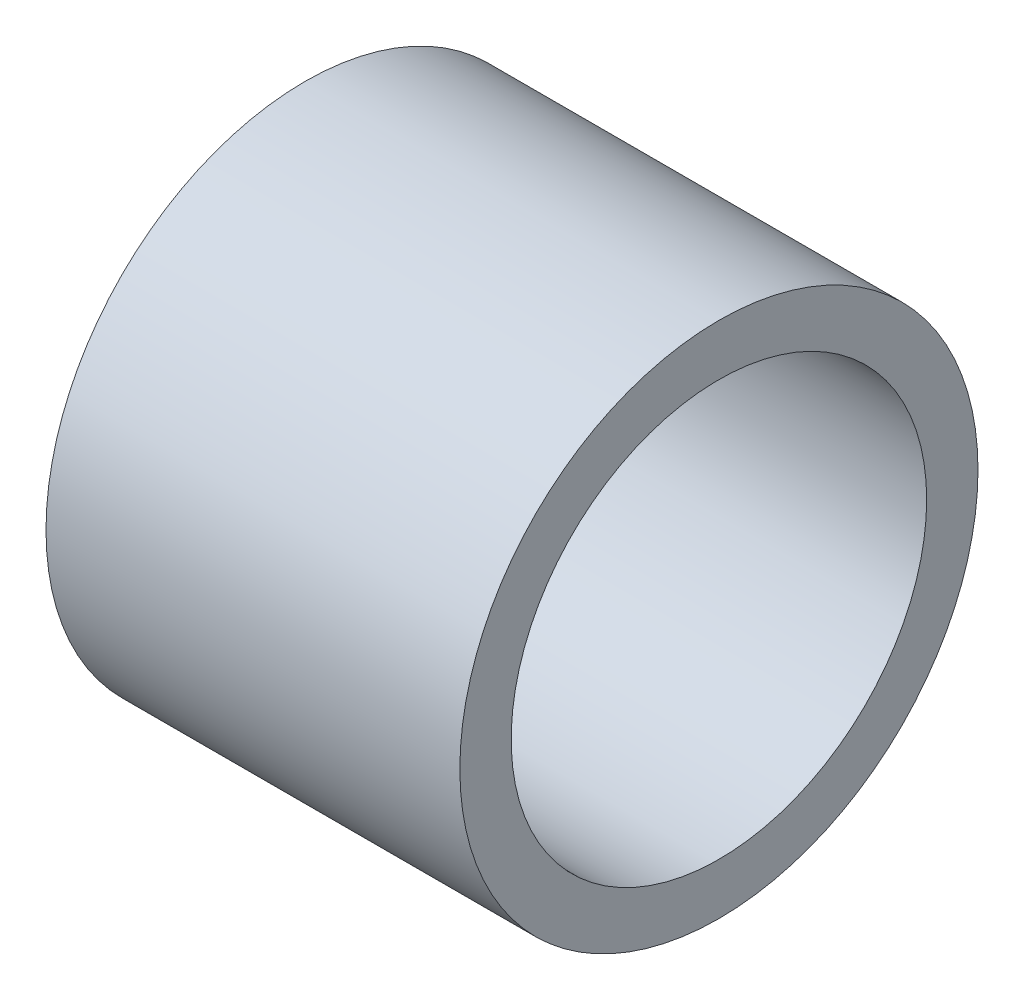
ISO-10303-21;
HEADER;
FILE_DESCRIPTION(('STEP AP214'),'2;1');
FILE_NAME('part.step','',(''),(''),'','','');
FILE_SCHEMA(('AUTOMOTIVE_DESIGN { 1 0 10303 214 1 1 1 1 }'));
ENDSEC;
DATA;
#1=APPLICATION_CONTEXT('core data for automotive mechanical design processes');
#2=APPLICATION_PROTOCOL_DEFINITION('international standard','automotive_design',2000,#1);
#3=PRODUCT_CONTEXT('',#1,'mechanical');
#4=PRODUCT('Part','Part','',(#3));
#5=PRODUCT_RELATED_PRODUCT_CATEGORY('part','',(#4));
#6=PRODUCT_DEFINITION_FORMATION('','',#4);
#7=PRODUCT_DEFINITION_CONTEXT('part definition',#1,'design');
#8=PRODUCT_DEFINITION('design','',#6,#7);
#9=PRODUCT_DEFINITION_SHAPE('','',#8);
#10=(LENGTH_UNIT() NAMED_UNIT(*) SI_UNIT(.MILLI.,.METRE.));
#11=(NAMED_UNIT(*) PLANE_ANGLE_UNIT() SI_UNIT($,.RADIAN.));
#12=(NAMED_UNIT(*) SI_UNIT($,.STERADIAN.) SOLID_ANGLE_UNIT());
#13=UNCERTAINTY_MEASURE_WITH_UNIT(LENGTH_MEASURE(1.E-05),#10,'distance_accuracy_value','');
#14=(GEOMETRIC_REPRESENTATION_CONTEXT(3) GLOBAL_UNCERTAINTY_ASSIGNED_CONTEXT((#13)) GLOBAL_UNIT_ASSIGNED_CONTEXT((#10,
#11,#12)) REPRESENTATION_CONTEXT('',''));
#15=CARTESIAN_POINT('',(0.,0.,0.));
#16=DIRECTION('',(0.,0.,1.));
#17=DIRECTION('',(1.,0.,0.));
#18=AXIS2_PLACEMENT_3D('',#15,#16,#17);
#19=CARTESIAN_POINT('',(3.175,0.,0.));
#20=DIRECTION('',(1.,0.,0.));
#21=DIRECTION('',(0.,0.,-1.));
#22=AXIS2_PLACEMENT_3D('',#19,#20,#21);
#23=PLANE('',#22);
#24=CARTESIAN_POINT('',(3.175,0.,0.));
#25=DIRECTION('',(1.,0.,0.));
#26=DIRECTION('',(0.,0.,-1.));
#27=AXIS2_PLACEMENT_3D('',#24,#25,#26);
#28=CIRCLE('',#27,3.9751);
#29=CARTESIAN_POINT('',(3.175,0.,-3.9751));
#30=VERTEX_POINT('',#29);
#31=EDGE_CURVE('E10',#30,#30,#28,.T.);
#32=ORIENTED_EDGE('',*,*,#31,.T.);
#33=EDGE_LOOP('',(#32));
#34=FACE_BOUND('',#33,.T.);
#35=CARTESIAN_POINT('',(3.175,0.,0.));
#36=DIRECTION('',(1.,0.,0.));
#37=DIRECTION('',(0.,0.,-1.));
#38=AXIS2_PLACEMENT_3D('',#35,#36,#37);
#39=CIRCLE('',#38,3.1877);
#40=CARTESIAN_POINT('',(3.175,0.,-3.1877));
#41=VERTEX_POINT('',#40);
#42=EDGE_CURVE('E57',#41,#41,#39,.T.);
#43=ORIENTED_EDGE('',*,*,#42,.F.);
#44=EDGE_LOOP('',(#43));
#45=FACE_BOUND('',#44,.T.);
#46=ADVANCED_FACE('F43',(#34,#45),#23,.T.);
#47=CARTESIAN_POINT('',(-3.175,0.,0.));
#48=DIRECTION('',(1.,0.,0.));
#49=DIRECTION('',(0.,0.,-1.));
#50=AXIS2_PLACEMENT_3D('',#47,#48,#49);
#51=PLANE('',#50);
#52=CARTESIAN_POINT('',(-3.175,0.,0.));
#53=DIRECTION('',(1.,0.,0.));
#54=DIRECTION('',(0.,0.,-1.));
#55=AXIS2_PLACEMENT_3D('',#52,#53,#54);
#56=CIRCLE('',#55,3.9751);
#57=CARTESIAN_POINT('',(-3.175,0.,-3.9751));
#58=VERTEX_POINT('',#57);
#59=EDGE_CURVE('E47',#58,#58,#56,.T.);
#60=ORIENTED_EDGE('',*,*,#59,.F.);
#61=EDGE_LOOP('',(#60));
#62=FACE_BOUND('',#61,.T.);
#63=CARTESIAN_POINT('',(-3.175,0.,0.));
#64=DIRECTION('',(1.,0.,0.));
#65=DIRECTION('',(0.,0.,-1.));
#66=AXIS2_PLACEMENT_3D('',#63,#64,#65);
#67=CIRCLE('',#66,3.1877);
#68=CARTESIAN_POINT('',(-3.175,0.,-3.1877));
#69=VERTEX_POINT('',#68);
#70=EDGE_CURVE('E59',#69,#69,#67,.T.);
#71=ORIENTED_EDGE('',*,*,#70,.T.);
#72=EDGE_LOOP('',(#71));
#73=FACE_BOUND('',#72,.T.);
#74=ADVANCED_FACE('F70',(#62,#73),#51,.F.);
#75=CARTESIAN_POINT('',(3.175,0.,0.));
#76=DIRECTION('',(-1.,0.,0.));
#77=DIRECTION('',(0.,0.,1.));
#78=AXIS2_PLACEMENT_3D('',#75,#76,#77);
#79=CYLINDRICAL_SURFACE('',#78,3.9751);
#80=ORIENTED_EDGE('',*,*,#31,.F.);
#81=EDGE_LOOP('',(#80));
#82=FACE_BOUND('',#81,.T.);
#83=ORIENTED_EDGE('',*,*,#59,.T.);
#84=EDGE_LOOP('',(#83));
#85=FACE_BOUND('',#84,.T.);
#86=ADVANCED_FACE('F45',(#82,#85),#79,.T.);
#87=CARTESIAN_POINT('',(3.175,0.,0.));
#88=DIRECTION('',(-1.,0.,0.));
#89=DIRECTION('',(0.,0.,1.));
#90=AXIS2_PLACEMENT_3D('',#87,#88,#89);
#91=CYLINDRICAL_SURFACE('',#90,3.1877);
#92=ORIENTED_EDGE('',*,*,#42,.T.);
#93=EDGE_LOOP('',(#92));
#94=FACE_BOUND('',#93,.T.);
#95=ORIENTED_EDGE('',*,*,#70,.F.);
#96=EDGE_LOOP('',(#95));
#97=FACE_BOUND('',#96,.T.);
#98=ADVANCED_FACE('F66',(#94,#97),#91,.F.);
#99=CLOSED_SHELL('',(#46,#74,#86,#98));
#100=MANIFOLD_SOLID_BREP('B2',#99);
#101=ADVANCED_BREP_SHAPE_REPRESENTATION('',(#18,#100),#14);
#102=SHAPE_DEFINITION_REPRESENTATION(#9,#101);
ENDSEC;
END-ISO-10303-21;
